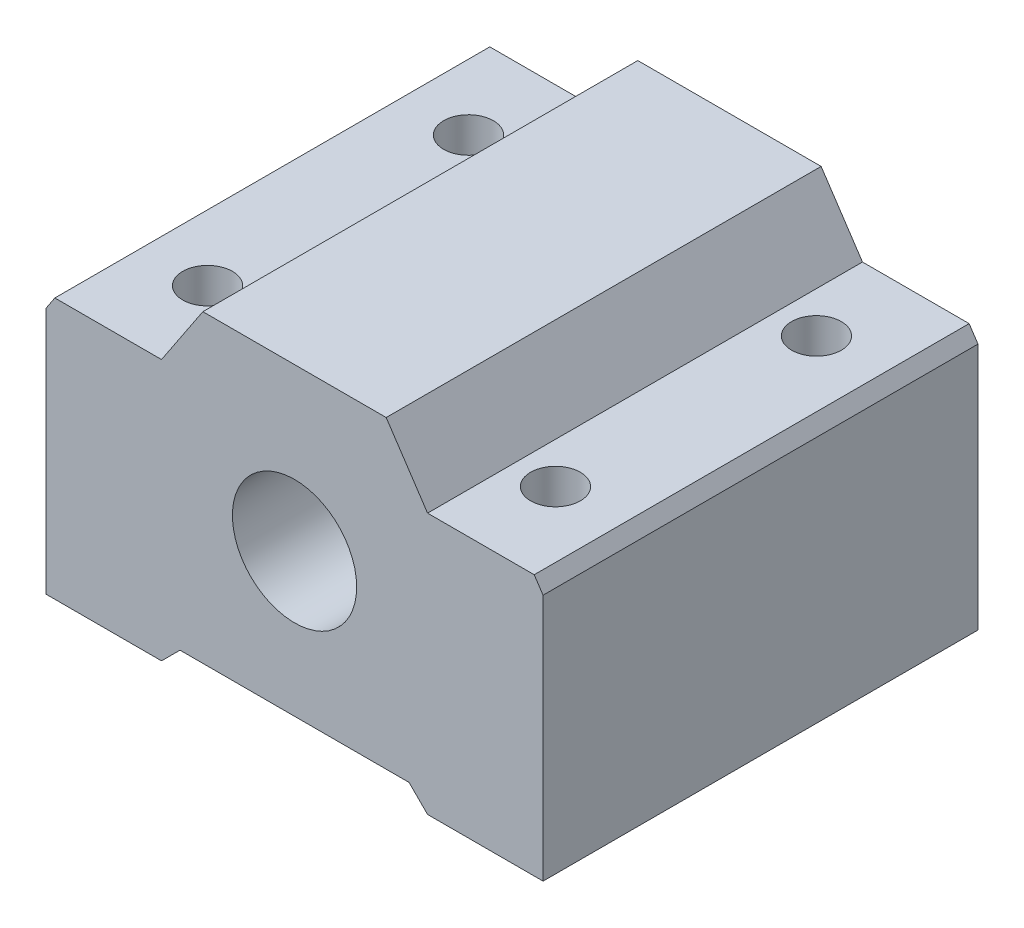
ISO-10303-21;
HEADER;
FILE_DESCRIPTION(('STEP AP214'),'2;1');
FILE_NAME('part.step','',(''),(''),'','','');
FILE_SCHEMA(('AUTOMOTIVE_DESIGN { 1 0 10303 214 1 1 1 1 }'));
ENDSEC;
DATA;
#1=APPLICATION_CONTEXT('core data for automotive mechanical design processes');
#2=APPLICATION_PROTOCOL_DEFINITION('international standard','automotive_design',2000,#1);
#3=PRODUCT_CONTEXT('',#1,'mechanical');
#4=PRODUCT('Part','Part','',(#3));
#5=PRODUCT_RELATED_PRODUCT_CATEGORY('part','',(#4));
#6=PRODUCT_DEFINITION_FORMATION('','',#4);
#7=PRODUCT_DEFINITION_CONTEXT('part definition',#1,'design');
#8=PRODUCT_DEFINITION('design','',#6,#7);
#9=PRODUCT_DEFINITION_SHAPE('','',#8);
#10=(LENGTH_UNIT() NAMED_UNIT(*) SI_UNIT(.MILLI.,.METRE.));
#11=(NAMED_UNIT(*) PLANE_ANGLE_UNIT() SI_UNIT($,.RADIAN.));
#12=(NAMED_UNIT(*) SI_UNIT($,.STERADIAN.) SOLID_ANGLE_UNIT());
#13=UNCERTAINTY_MEASURE_WITH_UNIT(LENGTH_MEASURE(1.E-05),#10,'distance_accuracy_value','');
#14=(GEOMETRIC_REPRESENTATION_CONTEXT(3) GLOBAL_UNCERTAINTY_ASSIGNED_CONTEXT((#13)) GLOBAL_UNIT_ASSIGNED_CONTEXT((#10,
#11,#12)) REPRESENTATION_CONTEXT('',''));
#15=CARTESIAN_POINT('',(0.,0.,0.));
#16=DIRECTION('',(0.,0.,1.));
#17=DIRECTION('',(1.,0.,0.));
#18=AXIS2_PLACEMENT_3D('',#15,#16,#17);
#19=CARTESIAN_POINT('',(0.,0.,35.));
#20=DIRECTION('',(0.,0.,1.));
#21=DIRECTION('',(1.,0.,0.));
#22=AXIS2_PLACEMENT_3D('',#19,#20,#21);
#23=PLANE('',#22);
#24=DIRECTION('',(0.,-1.,0.));
#25=VECTOR('',#24,1.);
#26=CARTESIAN_POINT('',(-20.,-13.,35.));
#27=LINE('',#26,#25);
#28=CARTESIAN_POINT('',(-20.,6.92929234599729,35.));
#29=VERTEX_POINT('',#28);
#30=CARTESIAN_POINT('',(-20.,-13.,35.));
#31=VERTEX_POINT('',#30);
#32=EDGE_CURVE('E193',#29,#31,#27,.T.);
#33=ORIENTED_EDGE('',*,*,#32,.T.);
#34=DIRECTION('',(1.,0.,0.));
#35=VECTOR('',#34,1.);
#36=CARTESIAN_POINT('',(-20.,-13.,35.));
#37=LINE('',#36,#35);
#38=CARTESIAN_POINT('',(-10.7048530087988,-13.,35.));
#39=VERTEX_POINT('',#38);
#40=EDGE_CURVE('E110',#31,#39,#37,.T.);
#41=ORIENTED_EDGE('',*,*,#40,.T.);
#42=DIRECTION('',(0.707106781186548,0.707106781186547,0.));
#43=VECTOR('',#42,1.);
#44=CARTESIAN_POINT('',(-10.7048530087988,-13.,35.));
#45=LINE('',#44,#43);
#46=CARTESIAN_POINT('',(-9.21653874939967,-11.5116857406009,35.));
#47=VERTEX_POINT('',#46);
#48=EDGE_CURVE('E226',#39,#47,#45,.T.);
#49=ORIENTED_EDGE('',*,*,#48,.T.);
#50=DIRECTION('',(1.,0.,0.));
#51=VECTOR('',#50,1.);
#52=CARTESIAN_POINT('',(-9.21653874939967,-11.5116857406009,35.));
#53=LINE('',#52,#51);
#54=CARTESIAN_POINT('',(9.21653874939963,-11.5116857406009,35.));
#55=VERTEX_POINT('',#54);
#56=EDGE_CURVE('E244',#47,#55,#53,.T.);
#57=ORIENTED_EDGE('',*,*,#56,.T.);
#58=DIRECTION('',(0.707106781186556,-0.707106781186539,0.));
#59=VECTOR('',#58,1.);
#60=CARTESIAN_POINT('',(10.7048530087988,-13.,35.));
#61=LINE('',#60,#59);
#62=CARTESIAN_POINT('',(10.7048530087988,-13.,35.));
#63=VERTEX_POINT('',#62);
#64=EDGE_CURVE('E241',#55,#63,#61,.T.);
#65=ORIENTED_EDGE('',*,*,#64,.T.);
#66=DIRECTION('',(1.,0.,0.));
#67=VECTOR('',#66,1.);
#68=CARTESIAN_POINT('',(12.1931672681979,-13.,35.));
#69=LINE('',#68,#67);
#70=CARTESIAN_POINT('',(20.,-13.,35.));
#71=VERTEX_POINT('',#70);
#72=EDGE_CURVE('E243',#63,#71,#69,.T.);
#73=ORIENTED_EDGE('',*,*,#72,.T.);
#74=DIRECTION('',(0.,1.,0.));
#75=VECTOR('',#74,1.);
#76=CARTESIAN_POINT('',(20.,-13.,35.));
#77=LINE('',#76,#75);
#78=CARTESIAN_POINT('',(20.,6.92929234599729,35.));
#79=VERTEX_POINT('',#78);
#80=EDGE_CURVE('E246',#71,#79,#77,.T.);
#81=ORIENTED_EDGE('',*,*,#80,.T.);
#82=DIRECTION('',(-0.554143598296849,0.832421090834813,0.));
#83=VECTOR('',#82,1.);
#84=CARTESIAN_POINT('',(19.2872287852318,8.00000000000001,35.));
#85=LINE('',#84,#83);
#86=CARTESIAN_POINT('',(19.2872287852318,8.00000000000001,35.));
#87=VERTEX_POINT('',#86);
#88=EDGE_CURVE('E252',#79,#87,#85,.T.);
#89=ORIENTED_EDGE('',*,*,#88,.T.);
#90=DIRECTION('',(-1.,0.,0.));
#91=VECTOR('',#90,1.);
#92=CARTESIAN_POINT('',(10.7048530087988,8.00000000000001,35.));
#93=LINE('',#92,#91);
#94=CARTESIAN_POINT('',(10.7048530087988,8.00000000000001,35.));
#95=VERTEX_POINT('',#94);
#96=EDGE_CURVE('E254',#87,#95,#93,.T.);
#97=ORIENTED_EDGE('',*,*,#96,.T.);
#98=DIRECTION('',(-0.554143598296849,0.832421090834813,0.));
#99=VECTOR('',#98,1.);
#100=CARTESIAN_POINT('',(7.37634773425612,13.,35.));
#101=LINE('',#100,#99);
#102=CARTESIAN_POINT('',(7.37634773425612,13.,35.));
#103=VERTEX_POINT('',#102);
#104=EDGE_CURVE('E256',#95,#103,#101,.T.);
#105=ORIENTED_EDGE('',*,*,#104,.T.);
#106=DIRECTION('',(-1.,0.,0.));
#107=VECTOR('',#106,1.);
#108=CARTESIAN_POINT('',(-7.3763477342561,13.,35.));
#109=LINE('',#108,#107);
#110=CARTESIAN_POINT('',(-7.3763477342561,13.,35.));
#111=VERTEX_POINT('',#110);
#112=EDGE_CURVE('E147',#103,#111,#109,.T.);
#113=ORIENTED_EDGE('',*,*,#112,.T.);
#114=DIRECTION('',(-0.554143598296849,-0.832421090834813,0.));
#115=VECTOR('',#114,1.);
#116=CARTESIAN_POINT('',(-7.3763477342561,13.,35.));
#117=LINE('',#116,#115);
#118=CARTESIAN_POINT('',(-10.7048530087988,8.,35.));
#119=VERTEX_POINT('',#118);
#120=EDGE_CURVE('E141',#111,#119,#117,.T.);
#121=ORIENTED_EDGE('',*,*,#120,.T.);
#122=DIRECTION('',(-1.,0.,0.));
#123=VECTOR('',#122,1.);
#124=CARTESIAN_POINT('',(-10.7048530087988,8.,35.));
#125=LINE('',#124,#123);
#126=CARTESIAN_POINT('',(-19.2872287852317,8.,35.));
#127=VERTEX_POINT('',#126);
#128=EDGE_CURVE('E145',#119,#127,#125,.T.);
#129=ORIENTED_EDGE('',*,*,#128,.T.);
#130=DIRECTION('',(-0.554143598296849,-0.832421090834813,0.));
#131=VECTOR('',#130,1.);
#132=CARTESIAN_POINT('',(-19.2872287852317,8.,35.));
#133=LINE('',#132,#131);
#134=EDGE_CURVE('E49',#127,#29,#133,.T.);
#135=ORIENTED_EDGE('',*,*,#134,.T.);
#136=EDGE_LOOP('',(#33,#41,#49,#57,#65,#73,#81,#89,#97,#105,#113,#121,#129,#135));
#137=FACE_BOUND('',#136,.T.);
#138=CARTESIAN_POINT('',(0.,0.,35.));
#139=DIRECTION('',(0.,0.,1.));
#140=DIRECTION('',(1.,0.,0.));
#141=AXIS2_PLACEMENT_3D('',#138,#139,#140);
#142=CIRCLE('',#141,5.);
#143=CARTESIAN_POINT('',(5.,0.,35.));
#144=VERTEX_POINT('',#143);
#145=EDGE_CURVE('E169',#144,#144,#142,.T.);
#146=ORIENTED_EDGE('',*,*,#145,.F.);
#147=EDGE_LOOP('',(#146));
#148=FACE_BOUND('',#147,.T.);
#149=ADVANCED_FACE('F32',(#137,#148),#23,.T.);
#150=CARTESIAN_POINT('',(0.,0.,0.));
#151=DIRECTION('',(0.,0.,1.));
#152=DIRECTION('',(1.,0.,0.));
#153=AXIS2_PLACEMENT_3D('',#150,#151,#152);
#154=PLANE('',#153);
#155=DIRECTION('',(0.,-1.,0.));
#156=VECTOR('',#155,1.);
#157=CARTESIAN_POINT('',(-20.,-13.,0.));
#158=LINE('',#157,#156);
#159=CARTESIAN_POINT('',(-20.,6.92929234599729,0.));
#160=VERTEX_POINT('',#159);
#161=CARTESIAN_POINT('',(-20.,-13.,0.));
#162=VERTEX_POINT('',#161);
#163=EDGE_CURVE('E165',#160,#162,#158,.T.);
#164=ORIENTED_EDGE('',*,*,#163,.F.);
#165=DIRECTION('',(-0.554143598296849,-0.832421090834813,0.));
#166=VECTOR('',#165,1.);
#167=CARTESIAN_POINT('',(-19.2872287852317,8.,0.));
#168=LINE('',#167,#166);
#169=CARTESIAN_POINT('',(-19.2872287852317,8.,0.));
#170=VERTEX_POINT('',#169);
#171=EDGE_CURVE('E102',#170,#160,#168,.T.);
#172=ORIENTED_EDGE('',*,*,#171,.F.);
#173=DIRECTION('',(-1.,0.,0.));
#174=VECTOR('',#173,1.);
#175=CARTESIAN_POINT('',(-10.7048530087988,8.,0.));
#176=LINE('',#175,#174);
#177=CARTESIAN_POINT('',(-10.7048530087988,8.,0.));
#178=VERTEX_POINT('',#177);
#179=EDGE_CURVE('E96',#178,#170,#176,.T.);
#180=ORIENTED_EDGE('',*,*,#179,.F.);
#181=DIRECTION('',(-0.554143598296849,-0.832421090834813,0.));
#182=VECTOR('',#181,1.);
#183=CARTESIAN_POINT('',(-7.3763477342561,13.,0.));
#184=LINE('',#183,#182);
#185=CARTESIAN_POINT('',(-7.3763477342561,13.,0.));
#186=VERTEX_POINT('',#185);
#187=EDGE_CURVE('E155',#186,#178,#184,.T.);
#188=ORIENTED_EDGE('',*,*,#187,.F.);
#189=DIRECTION('',(-1.,0.,0.));
#190=VECTOR('',#189,1.);
#191=CARTESIAN_POINT('',(-7.3763477342561,13.,0.));
#192=LINE('',#191,#190);
#193=CARTESIAN_POINT('',(7.37634773425612,13.,0.));
#194=VERTEX_POINT('',#193);
#195=EDGE_CURVE('E188',#194,#186,#192,.T.);
#196=ORIENTED_EDGE('',*,*,#195,.F.);
#197=DIRECTION('',(-0.554143598296849,0.832421090834813,0.));
#198=VECTOR('',#197,1.);
#199=CARTESIAN_POINT('',(7.37634773425612,13.,0.));
#200=LINE('',#199,#198);
#201=CARTESIAN_POINT('',(10.7048530087988,8.00000000000001,0.));
#202=VERTEX_POINT('',#201);
#203=EDGE_CURVE('E186',#202,#194,#200,.T.);
#204=ORIENTED_EDGE('',*,*,#203,.F.);
#205=DIRECTION('',(-1.,0.,0.));
#206=VECTOR('',#205,1.);
#207=CARTESIAN_POINT('',(10.7048530087988,8.00000000000001,0.));
#208=LINE('',#207,#206);
#209=CARTESIAN_POINT('',(19.2872287852318,8.00000000000001,0.));
#210=VERTEX_POINT('',#209);
#211=EDGE_CURVE('E184',#210,#202,#208,.T.);
#212=ORIENTED_EDGE('',*,*,#211,.F.);
#213=DIRECTION('',(-0.554143598296849,0.832421090834813,0.));
#214=VECTOR('',#213,1.);
#215=CARTESIAN_POINT('',(19.2872287852318,8.00000000000001,0.));
#216=LINE('',#215,#214);
#217=CARTESIAN_POINT('',(20.,6.92929234599729,0.));
#218=VERTEX_POINT('',#217);
#219=EDGE_CURVE('E182',#218,#210,#216,.T.);
#220=ORIENTED_EDGE('',*,*,#219,.F.);
#221=DIRECTION('',(0.,1.,0.));
#222=VECTOR('',#221,1.);
#223=CARTESIAN_POINT('',(20.,-13.,0.));
#224=LINE('',#223,#222);
#225=CARTESIAN_POINT('',(20.,-13.,0.));
#226=VERTEX_POINT('',#225);
#227=EDGE_CURVE('E180',#226,#218,#224,.T.);
#228=ORIENTED_EDGE('',*,*,#227,.F.);
#229=DIRECTION('',(1.,0.,0.));
#230=VECTOR('',#229,1.);
#231=CARTESIAN_POINT('',(12.1931672681979,-13.,0.));
#232=LINE('',#231,#230);
#233=CARTESIAN_POINT('',(10.7048530087988,-13.,0.));
#234=VERTEX_POINT('',#233);
#235=EDGE_CURVE('E178',#234,#226,#232,.T.);
#236=ORIENTED_EDGE('',*,*,#235,.F.);
#237=DIRECTION('',(0.707106781186556,-0.707106781186539,0.));
#238=VECTOR('',#237,1.);
#239=CARTESIAN_POINT('',(10.7048530087988,-13.,0.));
#240=LINE('',#239,#238);
#241=CARTESIAN_POINT('',(9.21653874939963,-11.5116857406009,0.));
#242=VERTEX_POINT('',#241);
#243=EDGE_CURVE('E175',#242,#234,#240,.T.);
#244=ORIENTED_EDGE('',*,*,#243,.F.);
#245=DIRECTION('',(1.,0.,0.));
#246=VECTOR('',#245,1.);
#247=CARTESIAN_POINT('',(-9.21653874939967,-11.5116857406009,0.));
#248=LINE('',#247,#246);
#249=CARTESIAN_POINT('',(-9.21653874939967,-11.5116857406009,0.));
#250=VERTEX_POINT('',#249);
#251=EDGE_CURVE('E173',#250,#242,#248,.T.);
#252=ORIENTED_EDGE('',*,*,#251,.F.);
#253=DIRECTION('',(0.707106781186548,0.707106781186547,0.));
#254=VECTOR('',#253,1.);
#255=CARTESIAN_POINT('',(-10.7048530087988,-13.,0.));
#256=LINE('',#255,#254);
#257=CARTESIAN_POINT('',(-10.7048530087988,-13.,0.));
#258=VERTEX_POINT('',#257);
#259=EDGE_CURVE('E171',#258,#250,#256,.T.);
#260=ORIENTED_EDGE('',*,*,#259,.F.);
#261=DIRECTION('',(1.,0.,0.));
#262=VECTOR('',#261,1.);
#263=CARTESIAN_POINT('',(-12.1931672681979,-13.,0.));
#264=LINE('',#263,#262);
#265=EDGE_CURVE('E168',#162,#258,#264,.T.);
#266=ORIENTED_EDGE('',*,*,#265,.F.);
#267=EDGE_LOOP('',(#164,#172,#180,#188,#196,#204,#212,#220,#228,#236,#244,#252,#260,#266));
#268=FACE_BOUND('',#267,.T.);
#269=CARTESIAN_POINT('',(0.,0.,0.));
#270=DIRECTION('',(0.,0.,1.));
#271=DIRECTION('',(1.,0.,0.));
#272=AXIS2_PLACEMENT_3D('',#269,#270,#271);
#273=CIRCLE('',#272,5.);
#274=CARTESIAN_POINT('',(5.,0.,0.));
#275=VERTEX_POINT('',#274);
#276=EDGE_CURVE('E334',#275,#275,#273,.T.);
#277=ORIENTED_EDGE('',*,*,#276,.T.);
#278=EDGE_LOOP('',(#277));
#279=FACE_BOUND('',#278,.T.);
#280=ADVANCED_FACE('F230',(#268,#279),#154,.F.);
#281=CARTESIAN_POINT('',(-20.,-13.,35.));
#282=DIRECTION('',(1.,0.,0.));
#283=DIRECTION('',(0.,0.,-1.));
#284=AXIS2_PLACEMENT_3D('',#281,#282,#283);
#285=PLANE('',#284);
#286=ORIENTED_EDGE('',*,*,#163,.T.);
#287=DIRECTION('',(0.,0.,-1.));
#288=VECTOR('',#287,1.);
#289=CARTESIAN_POINT('',(-20.,-13.,35.));
#290=LINE('',#289,#288);
#291=EDGE_CURVE('E11',#31,#162,#290,.T.);
#292=ORIENTED_EDGE('',*,*,#291,.F.);
#293=ORIENTED_EDGE('',*,*,#32,.F.);
#294=DIRECTION('',(0.,0.,-1.));
#295=VECTOR('',#294,1.);
#296=CARTESIAN_POINT('',(-20.,6.92929234599729,35.));
#297=LINE('',#296,#295);
#298=EDGE_CURVE('E161',#29,#160,#297,.T.);
#299=ORIENTED_EDGE('',*,*,#298,.T.);
#300=EDGE_LOOP('',(#286,#292,#293,#299));
#301=FACE_BOUND('',#300,.T.);
#302=ADVANCED_FACE('F34',(#301),#285,.F.);
#303=CARTESIAN_POINT('',(-12.1931672681979,-13.,35.));
#304=DIRECTION('',(0.,1.,0.));
#305=DIRECTION('',(0.,0.,1.));
#306=AXIS2_PLACEMENT_3D('',#303,#304,#305);
#307=PLANE('',#306);
#308=CARTESIAN_POINT('',(-14.,-13.,7.00000000000001));
#309=DIRECTION('',(0.,-1.,0.));
#310=DIRECTION('',(0.,0.,-1.));
#311=AXIS2_PLACEMENT_3D('',#308,#309,#310);
#312=CIRCLE('',#311,2.);
#313=CARTESIAN_POINT('',(-14.,-13.,5.00000000000001));
#314=VERTEX_POINT('',#313);
#315=EDGE_CURVE('E309',#314,#314,#312,.T.);
#316=ORIENTED_EDGE('',*,*,#315,.F.);
#317=EDGE_LOOP('',(#316));
#318=FACE_BOUND('',#317,.T.);
#319=CARTESIAN_POINT('',(-14.,-13.,28.));
#320=DIRECTION('',(0.,-1.,0.));
#321=DIRECTION('',(0.,0.,-1.));
#322=AXIS2_PLACEMENT_3D('',#319,#320,#321);
#323=CIRCLE('',#322,2.);
#324=CARTESIAN_POINT('',(-14.,-13.,26.));
#325=VERTEX_POINT('',#324);
#326=EDGE_CURVE('E328',#325,#325,#323,.T.);
#327=ORIENTED_EDGE('',*,*,#326,.F.);
#328=EDGE_LOOP('',(#327));
#329=FACE_BOUND('',#328,.T.);
#330=ORIENTED_EDGE('',*,*,#265,.T.);
#331=DIRECTION('',(0.,0.,-1.));
#332=VECTOR('',#331,1.);
#333=CARTESIAN_POINT('',(-10.7048530087988,-13.,35.));
#334=LINE('',#333,#332);
#335=EDGE_CURVE('E41',#39,#258,#334,.T.);
#336=ORIENTED_EDGE('',*,*,#335,.F.);
#337=ORIENTED_EDGE('',*,*,#40,.F.);
#338=ORIENTED_EDGE('',*,*,#291,.T.);
#339=EDGE_LOOP('',(#330,#336,#337,#338));
#340=FACE_BOUND('',#339,.T.);
#341=ADVANCED_FACE('F348',(#318,#329,#340),#307,.F.);
#342=CARTESIAN_POINT('',(-10.7048530087988,-13.,35.));
#343=DIRECTION('',(-0.707106781186547,0.707106781186548,0.));
#344=DIRECTION('',(-0.707106781186548,-0.707106781186547,0.));
#345=AXIS2_PLACEMENT_3D('',#342,#343,#344);
#346=PLANE('',#345);
#347=ORIENTED_EDGE('',*,*,#259,.T.);
#348=DIRECTION('',(0.,0.,-1.));
#349=VECTOR('',#348,1.);
#350=CARTESIAN_POINT('',(-9.21653874939967,-11.5116857406009,35.));
#351=LINE('',#350,#349);
#352=EDGE_CURVE('E218',#47,#250,#351,.T.);
#353=ORIENTED_EDGE('',*,*,#352,.F.);
#354=ORIENTED_EDGE('',*,*,#48,.F.);
#355=ORIENTED_EDGE('',*,*,#335,.T.);
#356=EDGE_LOOP('',(#347,#353,#354,#355));
#357=FACE_BOUND('',#356,.T.);
#358=ADVANCED_FACE('F224',(#357),#346,.F.);
#359=CARTESIAN_POINT('',(-9.21653874939967,-11.5116857406009,35.));
#360=DIRECTION('',(0.,1.,0.));
#361=DIRECTION('',(0.,0.,1.));
#362=AXIS2_PLACEMENT_3D('',#359,#360,#361);
#363=PLANE('',#362);
#364=ORIENTED_EDGE('',*,*,#251,.T.);
#365=DIRECTION('',(0.,0.,-1.));
#366=VECTOR('',#365,1.);
#367=CARTESIAN_POINT('',(9.21653874939963,-11.5116857406009,35.));
#368=LINE('',#367,#366);
#369=EDGE_CURVE('E215',#55,#242,#368,.T.);
#370=ORIENTED_EDGE('',*,*,#369,.F.);
#371=ORIENTED_EDGE('',*,*,#56,.F.);
#372=ORIENTED_EDGE('',*,*,#352,.T.);
#373=EDGE_LOOP('',(#364,#370,#371,#372));
#374=FACE_BOUND('',#373,.T.);
#375=ADVANCED_FACE('F235',(#374),#363,.F.);
#376=CARTESIAN_POINT('',(10.7048530087988,-13.,35.));
#377=DIRECTION('',(0.707106781186539,0.707106781186556,0.));
#378=DIRECTION('',(-0.707106781186556,0.707106781186539,0.));
#379=AXIS2_PLACEMENT_3D('',#376,#377,#378);
#380=PLANE('',#379);
#381=ORIENTED_EDGE('',*,*,#243,.T.);
#382=DIRECTION('',(0.,0.,-1.));
#383=VECTOR('',#382,1.);
#384=CARTESIAN_POINT('',(10.7048530087988,-13.,35.));
#385=LINE('',#384,#383);
#386=EDGE_CURVE('E212',#63,#234,#385,.T.);
#387=ORIENTED_EDGE('',*,*,#386,.F.);
#388=ORIENTED_EDGE('',*,*,#64,.F.);
#389=ORIENTED_EDGE('',*,*,#369,.T.);
#390=EDGE_LOOP('',(#381,#387,#388,#389));
#391=FACE_BOUND('',#390,.T.);
#392=ADVANCED_FACE('F239',(#391),#380,.F.);
#393=CARTESIAN_POINT('',(12.1931672681979,-13.,35.));
#394=DIRECTION('',(0.,1.,0.));
#395=DIRECTION('',(-1.,0.,0.));
#396=AXIS2_PLACEMENT_3D('',#393,#394,#395);
#397=PLANE('',#396);
#398=CARTESIAN_POINT('',(14.,-13.,7.00000000000001));
#399=DIRECTION('',(0.,-1.,0.));
#400=DIRECTION('',(0.,0.,-1.));
#401=AXIS2_PLACEMENT_3D('',#398,#399,#400);
#402=CIRCLE('',#401,2.);
#403=CARTESIAN_POINT('',(14.,-13.,5.));
#404=VERTEX_POINT('',#403);
#405=EDGE_CURVE('E313',#404,#404,#402,.T.);
#406=ORIENTED_EDGE('',*,*,#405,.F.);
#407=EDGE_LOOP('',(#406));
#408=FACE_BOUND('',#407,.T.);
#409=CARTESIAN_POINT('',(14.,-13.,28.));
#410=DIRECTION('',(0.,-1.,0.));
#411=DIRECTION('',(0.,0.,-1.));
#412=AXIS2_PLACEMENT_3D('',#409,#410,#411);
#413=CIRCLE('',#412,2.00000000000001);
#414=CARTESIAN_POINT('',(14.,-13.,26.));
#415=VERTEX_POINT('',#414);
#416=EDGE_CURVE('E322',#415,#415,#413,.T.);
#417=ORIENTED_EDGE('',*,*,#416,.F.);
#418=EDGE_LOOP('',(#417));
#419=FACE_BOUND('',#418,.T.);
#420=ORIENTED_EDGE('',*,*,#235,.T.);
#421=DIRECTION('',(0.,0.,-1.));
#422=VECTOR('',#421,1.);
#423=CARTESIAN_POINT('',(20.,-13.,35.));
#424=LINE('',#423,#422);
#425=EDGE_CURVE('E209',#71,#226,#424,.T.);
#426=ORIENTED_EDGE('',*,*,#425,.F.);
#427=ORIENTED_EDGE('',*,*,#72,.F.);
#428=ORIENTED_EDGE('',*,*,#386,.T.);
#429=EDGE_LOOP('',(#420,#426,#427,#428));
#430=FACE_BOUND('',#429,.T.);
#431=ADVANCED_FACE('F361',(#408,#419,#430),#397,.F.);
#432=CARTESIAN_POINT('',(20.,-13.,35.));
#433=DIRECTION('',(-1.,0.,0.));
#434=DIRECTION('',(0.,-1.,0.));
#435=AXIS2_PLACEMENT_3D('',#432,#433,#434);
#436=PLANE('',#435);
#437=ORIENTED_EDGE('',*,*,#227,.T.);
#438=DIRECTION('',(0.,0.,-1.));
#439=VECTOR('',#438,1.);
#440=CARTESIAN_POINT('',(20.,6.92929234599729,35.));
#441=LINE('',#440,#439);
#442=EDGE_CURVE('E206',#79,#218,#441,.T.);
#443=ORIENTED_EDGE('',*,*,#442,.F.);
#444=ORIENTED_EDGE('',*,*,#80,.F.);
#445=ORIENTED_EDGE('',*,*,#425,.T.);
#446=EDGE_LOOP('',(#437,#443,#444,#445));
#447=FACE_BOUND('',#446,.T.);
#448=ADVANCED_FACE('F364',(#447),#436,.F.);
#449=CARTESIAN_POINT('',(19.2872287852318,8.00000000000001,35.));
#450=DIRECTION('',(-0.832421090834813,-0.554143598296849,0.));
#451=DIRECTION('',(0.554143598296849,-0.832421090834813,0.));
#452=AXIS2_PLACEMENT_3D('',#449,#450,#451);
#453=PLANE('',#452);
#454=ORIENTED_EDGE('',*,*,#219,.T.);
#455=DIRECTION('',(0.,0.,-1.));
#456=VECTOR('',#455,1.);
#457=CARTESIAN_POINT('',(19.2872287852318,8.00000000000001,35.));
#458=LINE('',#457,#456);
#459=EDGE_CURVE('E203',#87,#210,#458,.T.);
#460=ORIENTED_EDGE('',*,*,#459,.F.);
#461=ORIENTED_EDGE('',*,*,#88,.F.);
#462=ORIENTED_EDGE('',*,*,#442,.T.);
#463=EDGE_LOOP('',(#454,#460,#461,#462));
#464=FACE_BOUND('',#463,.T.);
#465=ADVANCED_FACE('F368',(#464),#453,.F.);
#466=CARTESIAN_POINT('',(10.7048530087988,8.00000000000001,35.));
#467=DIRECTION('',(0.,-1.,0.));
#468=DIRECTION('',(1.,0.,0.));
#469=AXIS2_PLACEMENT_3D('',#466,#467,#468);
#470=PLANE('',#469);
#471=CARTESIAN_POINT('',(14.,8.00000000000001,7.00000000000001));
#472=DIRECTION('',(0.,-1.,0.));
#473=DIRECTION('',(1.,0.,0.));
#474=AXIS2_PLACEMENT_3D('',#471,#472,#473);
#475=CIRCLE('',#474,2.);
#476=CARTESIAN_POINT('',(16.,8.00000000000001,7.00000000000001));
#477=VERTEX_POINT('',#476);
#478=EDGE_CURVE('E316',#477,#477,#475,.F.);
#479=ORIENTED_EDGE('',*,*,#478,.F.);
#480=EDGE_LOOP('',(#479));
#481=FACE_BOUND('',#480,.T.);
#482=CARTESIAN_POINT('',(14.,8.00000000000001,28.));
#483=DIRECTION('',(0.,-1.,0.));
#484=DIRECTION('',(1.,0.,0.));
#485=AXIS2_PLACEMENT_3D('',#482,#483,#484);
#486=CIRCLE('',#485,2.00000000000001);
#487=CARTESIAN_POINT('',(16.,8.00000000000001,28.));
#488=VERTEX_POINT('',#487);
#489=EDGE_CURVE('E325',#488,#488,#486,.F.);
#490=ORIENTED_EDGE('',*,*,#489,.F.);
#491=EDGE_LOOP('',(#490));
#492=FACE_BOUND('',#491,.T.);
#493=ORIENTED_EDGE('',*,*,#211,.T.);
#494=DIRECTION('',(0.,0.,-1.));
#495=VECTOR('',#494,1.);
#496=CARTESIAN_POINT('',(10.7048530087988,8.00000000000001,35.));
#497=LINE('',#496,#495);
#498=EDGE_CURVE('E200',#95,#202,#497,.T.);
#499=ORIENTED_EDGE('',*,*,#498,.F.);
#500=ORIENTED_EDGE('',*,*,#96,.F.);
#501=ORIENTED_EDGE('',*,*,#459,.T.);
#502=EDGE_LOOP('',(#493,#499,#500,#501));
#503=FACE_BOUND('',#502,.T.);
#504=ADVANCED_FACE('F372',(#481,#492,#503),#470,.F.);
#505=CARTESIAN_POINT('',(7.37634773425612,13.,35.));
#506=DIRECTION('',(-0.832421090834813,-0.554143598296849,0.));
#507=DIRECTION('',(0.554143598296849,-0.832421090834813,0.));
#508=AXIS2_PLACEMENT_3D('',#505,#506,#507);
#509=PLANE('',#508);
#510=ORIENTED_EDGE('',*,*,#203,.T.);
#511=DIRECTION('',(0.,0.,-1.));
#512=VECTOR('',#511,1.);
#513=CARTESIAN_POINT('',(7.37634773425612,13.,35.));
#514=LINE('',#513,#512);
#515=EDGE_CURVE('E197',#103,#194,#514,.T.);
#516=ORIENTED_EDGE('',*,*,#515,.F.);
#517=ORIENTED_EDGE('',*,*,#104,.F.);
#518=ORIENTED_EDGE('',*,*,#498,.T.);
#519=EDGE_LOOP('',(#510,#516,#517,#518));
#520=FACE_BOUND('',#519,.T.);
#521=ADVANCED_FACE('F262',(#520),#509,.F.);
#522=CARTESIAN_POINT('',(-7.3763477342561,13.,35.));
#523=DIRECTION('',(0.,-1.,0.));
#524=DIRECTION('',(1.,0.,0.));
#525=AXIS2_PLACEMENT_3D('',#522,#523,#524);
#526=PLANE('',#525);
#527=ORIENTED_EDGE('',*,*,#195,.T.);
#528=DIRECTION('',(0.,0.,-1.));
#529=VECTOR('',#528,1.);
#530=CARTESIAN_POINT('',(-7.3763477342561,13.,35.));
#531=LINE('',#530,#529);
#532=EDGE_CURVE('E156',#111,#186,#531,.T.);
#533=ORIENTED_EDGE('',*,*,#532,.F.);
#534=ORIENTED_EDGE('',*,*,#112,.F.);
#535=ORIENTED_EDGE('',*,*,#515,.T.);
#536=EDGE_LOOP('',(#527,#533,#534,#535));
#537=FACE_BOUND('',#536,.T.);
#538=ADVANCED_FACE('F266',(#537),#526,.F.);
#539=CARTESIAN_POINT('',(-7.3763477342561,13.,35.));
#540=DIRECTION('',(0.832421090834814,-0.554143598296849,0.));
#541=DIRECTION('',(0.554143598296849,0.832421090834814,0.));
#542=AXIS2_PLACEMENT_3D('',#539,#540,#541);
#543=PLANE('',#542);
#544=ORIENTED_EDGE('',*,*,#187,.T.);
#545=DIRECTION('',(0.,0.,-1.));
#546=VECTOR('',#545,1.);
#547=CARTESIAN_POINT('',(-10.7048530087988,8.,35.));
#548=LINE('',#547,#546);
#549=EDGE_CURVE('E152',#119,#178,#548,.T.);
#550=ORIENTED_EDGE('',*,*,#549,.F.);
#551=ORIENTED_EDGE('',*,*,#120,.F.);
#552=ORIENTED_EDGE('',*,*,#532,.T.);
#553=EDGE_LOOP('',(#544,#550,#551,#552));
#554=FACE_BOUND('',#553,.T.);
#555=ADVANCED_FACE('F153',(#554),#543,.F.);
#556=CARTESIAN_POINT('',(-10.7048530087988,8.,35.));
#557=DIRECTION('',(0.,-1.,0.));
#558=DIRECTION('',(1.,0.,0.));
#559=AXIS2_PLACEMENT_3D('',#556,#557,#558);
#560=PLANE('',#559);
#561=CARTESIAN_POINT('',(-14.,8.,7.00000000000001));
#562=DIRECTION('',(0.,-1.,0.));
#563=DIRECTION('',(1.,0.,0.));
#564=AXIS2_PLACEMENT_3D('',#561,#562,#563);
#565=CIRCLE('',#564,2.);
#566=CARTESIAN_POINT('',(-12.,8.,7.00000000000001));
#567=VERTEX_POINT('',#566);
#568=EDGE_CURVE('E312',#567,#567,#565,.F.);
#569=ORIENTED_EDGE('',*,*,#568,.F.);
#570=EDGE_LOOP('',(#569));
#571=FACE_BOUND('',#570,.T.);
#572=CARTESIAN_POINT('',(-14.,8.,28.));
#573=DIRECTION('',(0.,-1.,0.));
#574=DIRECTION('',(1.,0.,0.));
#575=AXIS2_PLACEMENT_3D('',#572,#573,#574);
#576=CIRCLE('',#575,2.);
#577=CARTESIAN_POINT('',(-12.,8.,28.));
#578=VERTEX_POINT('',#577);
#579=EDGE_CURVE('E331',#578,#578,#576,.F.);
#580=ORIENTED_EDGE('',*,*,#579,.F.);
#581=EDGE_LOOP('',(#580));
#582=FACE_BOUND('',#581,.T.);
#583=ORIENTED_EDGE('',*,*,#179,.T.);
#584=DIRECTION('',(0.,0.,-1.));
#585=VECTOR('',#584,1.);
#586=CARTESIAN_POINT('',(-19.2872287852317,8.,35.));
#587=LINE('',#586,#585);
#588=EDGE_CURVE('E157',#127,#170,#587,.T.);
#589=ORIENTED_EDGE('',*,*,#588,.F.);
#590=ORIENTED_EDGE('',*,*,#128,.F.);
#591=ORIENTED_EDGE('',*,*,#549,.T.);
#592=EDGE_LOOP('',(#583,#589,#590,#591));
#593=FACE_BOUND('',#592,.T.);
#594=ADVANCED_FACE('F159',(#571,#582,#593),#560,.F.);
#595=CARTESIAN_POINT('',(-19.2872287852317,8.,35.));
#596=DIRECTION('',(0.832421090834813,-0.554143598296849,0.));
#597=DIRECTION('',(0.554143598296849,0.832421090834813,0.));
#598=AXIS2_PLACEMENT_3D('',#595,#596,#597);
#599=PLANE('',#598);
#600=ORIENTED_EDGE('',*,*,#171,.T.);
#601=ORIENTED_EDGE('',*,*,#298,.F.);
#602=ORIENTED_EDGE('',*,*,#134,.F.);
#603=ORIENTED_EDGE('',*,*,#588,.T.);
#604=EDGE_LOOP('',(#600,#601,#602,#603));
#605=FACE_BOUND('',#604,.T.);
#606=ADVANCED_FACE('F270',(#605),#599,.F.);
#607=CARTESIAN_POINT('',(0.,0.,35.));
#608=DIRECTION('',(0.,0.,-1.));
#609=DIRECTION('',(-1.,0.,0.));
#610=AXIS2_PLACEMENT_3D('',#607,#608,#609);
#611=CYLINDRICAL_SURFACE('',#610,5.);
#612=ORIENTED_EDGE('',*,*,#145,.T.);
#613=EDGE_LOOP('',(#612));
#614=FACE_BOUND('',#613,.T.);
#615=ORIENTED_EDGE('',*,*,#276,.F.);
#616=EDGE_LOOP('',(#615));
#617=FACE_BOUND('',#616,.T.);
#618=ADVANCED_FACE('F272',(#614,#617),#611,.F.);
#619=CARTESIAN_POINT('',(-14.,13.001,28.));
#620=DIRECTION('',(0.,-1.,0.));
#621=DIRECTION('',(0.,0.,-1.));
#622=AXIS2_PLACEMENT_3D('',#619,#620,#621);
#623=CYLINDRICAL_SURFACE('',#622,2.);
#624=ORIENTED_EDGE('',*,*,#326,.T.);
#625=EDGE_LOOP('',(#624));
#626=FACE_BOUND('',#625,.T.);
#627=ORIENTED_EDGE('',*,*,#579,.T.);
#628=EDGE_LOOP('',(#627));
#629=FACE_BOUND('',#628,.T.);
#630=ADVANCED_FACE('F278',(#626,#629),#623,.F.);
#631=CARTESIAN_POINT('',(14.,13.001,28.));
#632=DIRECTION('',(0.,-1.,0.));
#633=DIRECTION('',(0.,0.,-1.));
#634=AXIS2_PLACEMENT_3D('',#631,#632,#633);
#635=CYLINDRICAL_SURFACE('',#634,2.00000000000001);
#636=ORIENTED_EDGE('',*,*,#416,.T.);
#637=EDGE_LOOP('',(#636));
#638=FACE_BOUND('',#637,.T.);
#639=ORIENTED_EDGE('',*,*,#489,.T.);
#640=EDGE_LOOP('',(#639));
#641=FACE_BOUND('',#640,.T.);
#642=ADVANCED_FACE('F292',(#638,#641),#635,.F.);
#643=CARTESIAN_POINT('',(14.,13.001,7.00000000000001));
#644=DIRECTION('',(0.,-1.,0.));
#645=DIRECTION('',(0.,0.,-1.));
#646=AXIS2_PLACEMENT_3D('',#643,#644,#645);
#647=CYLINDRICAL_SURFACE('',#646,2.);
#648=ORIENTED_EDGE('',*,*,#405,.T.);
#649=EDGE_LOOP('',(#648));
#650=FACE_BOUND('',#649,.T.);
#651=ORIENTED_EDGE('',*,*,#478,.T.);
#652=EDGE_LOOP('',(#651));
#653=FACE_BOUND('',#652,.T.);
#654=ADVANCED_FACE('F296',(#650,#653),#647,.F.);
#655=CARTESIAN_POINT('',(-14.,13.001,7.00000000000001));
#656=DIRECTION('',(0.,-1.,0.));
#657=DIRECTION('',(0.,0.,-1.));
#658=AXIS2_PLACEMENT_3D('',#655,#656,#657);
#659=CYLINDRICAL_SURFACE('',#658,2.);
#660=ORIENTED_EDGE('',*,*,#315,.T.);
#661=EDGE_LOOP('',(#660));
#662=FACE_BOUND('',#661,.T.);
#663=ORIENTED_EDGE('',*,*,#568,.T.);
#664=EDGE_LOOP('',(#663));
#665=FACE_BOUND('',#664,.T.);
#666=ADVANCED_FACE('F300',(#662,#665),#659,.F.);
#667=CLOSED_SHELL('',(#149,#280,#302,#341,#358,#375,#392,#431,#448,#465,#504,#521,#538,#555,
#594,#606,#618,#630,#642,#654,#666));
#668=MANIFOLD_SOLID_BREP('B2',#667);
#669=ADVANCED_BREP_SHAPE_REPRESENTATION('',(#18,#668),#14);
#670=SHAPE_DEFINITION_REPRESENTATION(#9,#669);
ENDSEC;
END-ISO-10303-21;
